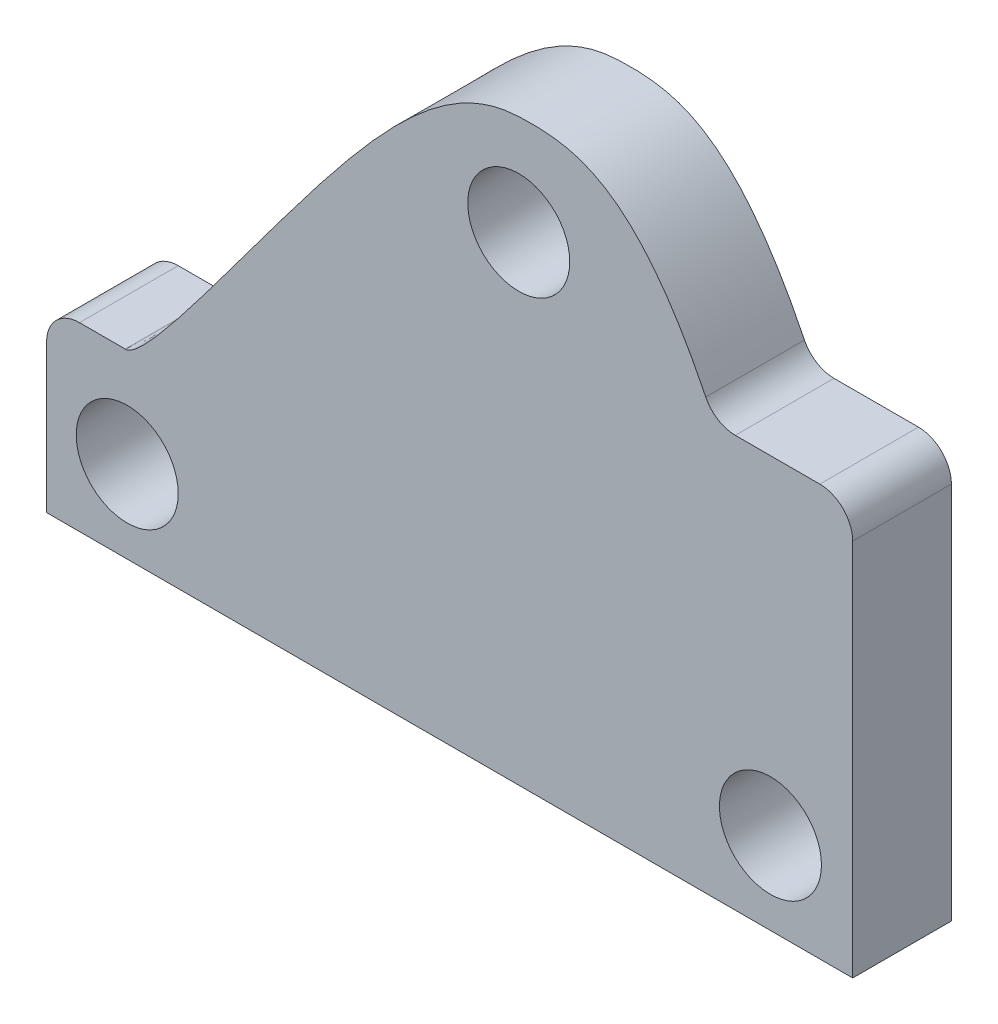
ISO-10303-21;
HEADER;
FILE_DESCRIPTION(('STEP AP214'),'2;1');
FILE_NAME('part.step','',(''),(''),'','','');
FILE_SCHEMA(('AUTOMOTIVE_DESIGN { 1 0 10303 214 1 1 1 1 }'));
ENDSEC;
DATA;
#1=APPLICATION_CONTEXT('core data for automotive mechanical design processes');
#2=APPLICATION_PROTOCOL_DEFINITION('international standard','automotive_design',2000,#1);
#3=PRODUCT_CONTEXT('',#1,'mechanical');
#4=PRODUCT('Part','Part','',(#3));
#5=PRODUCT_RELATED_PRODUCT_CATEGORY('part','',(#4));
#6=PRODUCT_DEFINITION_FORMATION('','',#4);
#7=PRODUCT_DEFINITION_CONTEXT('part definition',#1,'design');
#8=PRODUCT_DEFINITION('design','',#6,#7);
#9=PRODUCT_DEFINITION_SHAPE('','',#8);
#10=(LENGTH_UNIT() NAMED_UNIT(*) SI_UNIT(.MILLI.,.METRE.));
#11=(NAMED_UNIT(*) PLANE_ANGLE_UNIT() SI_UNIT($,.RADIAN.));
#12=(NAMED_UNIT(*) SI_UNIT($,.STERADIAN.) SOLID_ANGLE_UNIT());
#13=UNCERTAINTY_MEASURE_WITH_UNIT(LENGTH_MEASURE(1.E-05),#10,'distance_accuracy_value','');
#14=(GEOMETRIC_REPRESENTATION_CONTEXT(3) GLOBAL_UNCERTAINTY_ASSIGNED_CONTEXT((#13)) GLOBAL_UNIT_ASSIGNED_CONTEXT((#10,
#11,#12)) REPRESENTATION_CONTEXT('',''));
#15=CARTESIAN_POINT('',(0.,0.,0.));
#16=DIRECTION('',(0.,0.,1.));
#17=DIRECTION('',(1.,0.,0.));
#18=AXIS2_PLACEMENT_3D('',#15,#16,#17);
#19=CARTESIAN_POINT('',(-28.575,-10.922,3.81));
#20=DIRECTION('',(0.,0.,1.));
#21=DIRECTION('',(1.,0.,0.));
#22=AXIS2_PLACEMENT_3D('',#19,#20,#21);
#23=PLANE('',#22);
#24=CARTESIAN_POINT('',(-24.892,-16.002,3.81));
#25=DIRECTION('',(0.,0.,1.));
#26=DIRECTION('',(1.,0.,0.));
#27=AXIS2_PLACEMENT_3D('',#24,#25,#26);
#28=CIRCLE('',#27,3.937);
#29=CARTESIAN_POINT('',(-20.955,-16.002,3.81));
#30=VERTEX_POINT('',#29);
#31=EDGE_CURVE('E224',#30,#30,#28,.T.);
#32=ORIENTED_EDGE('',*,*,#31,.F.);
#33=EDGE_LOOP('',(#32));
#34=FACE_BOUND('',#33,.T.);
#35=CARTESIAN_POINT('',(-28.575,-10.922,3.81));
#36=DIRECTION('',(0.,0.,1.));
#37=DIRECTION('',(1.,0.,0.));
#38=AXIS2_PLACEMENT_3D('',#35,#36,#37);
#39=CIRCLE('',#38,2.54);
#40=CARTESIAN_POINT('',(-28.575,-8.38200000000001,3.81));
#41=VERTEX_POINT('',#40);
#42=CARTESIAN_POINT('',(-31.115,-10.922,3.81));
#43=VERTEX_POINT('',#42);
#44=EDGE_CURVE('E173',#41,#43,#39,.T.);
#45=ORIENTED_EDGE('',*,*,#44,.T.);
#46=DIRECTION('',(0.,-1.,0.));
#47=VECTOR('',#46,1.);
#48=CARTESIAN_POINT('',(-31.115,-22.352,3.81));
#49=LINE('',#48,#47);
#50=CARTESIAN_POINT('',(-31.115,-22.352,3.81));
#51=VERTEX_POINT('',#50);
#52=EDGE_CURVE('E103',#43,#51,#49,.T.);
#53=ORIENTED_EDGE('',*,*,#52,.T.);
#54=DIRECTION('',(1.,0.,0.));
#55=VECTOR('',#54,1.);
#56=CARTESIAN_POINT('',(-31.115,-22.352,3.81));
#57=LINE('',#56,#55);
#58=CARTESIAN_POINT('',(31.115,-22.352,3.81));
#59=VERTEX_POINT('',#58);
#60=EDGE_CURVE('E194',#51,#59,#57,.T.);
#61=ORIENTED_EDGE('',*,*,#60,.T.);
#62=DIRECTION('',(0.,1.,0.));
#63=VECTOR('',#62,1.);
#64=CARTESIAN_POINT('',(31.115,6.85799999999998,3.81));
#65=LINE('',#64,#63);
#66=CARTESIAN_POINT('',(31.115,6.85799999999998,3.81));
#67=VERTEX_POINT('',#66);
#68=EDGE_CURVE('E213',#59,#67,#65,.T.);
#69=ORIENTED_EDGE('',*,*,#68,.T.);
#70=CARTESIAN_POINT('',(28.575,6.858,3.81));
#71=DIRECTION('',(0.,0.,1.));
#72=DIRECTION('',(1.,0.,0.));
#73=AXIS2_PLACEMENT_3D('',#70,#71,#72);
#74=CIRCLE('',#73,2.54);
#75=CARTESIAN_POINT('',(28.575,9.398,3.81));
#76=VERTEX_POINT('',#75);
#77=EDGE_CURVE('E210',#67,#76,#74,.T.);
#78=ORIENTED_EDGE('',*,*,#77,.T.);
#79=DIRECTION('',(-1.,0.,0.));
#80=VECTOR('',#79,1.);
#81=CARTESIAN_POINT('',(28.575,9.398,3.81));
#82=LINE('',#81,#80);
#83=CARTESIAN_POINT('',(22.0521966057833,9.398,3.81));
#84=VERTEX_POINT('',#83);
#85=EDGE_CURVE('E212',#76,#84,#82,.T.);
#86=ORIENTED_EDGE('',*,*,#85,.T.);
#87=CARTESIAN_POINT('',(22.0521966057833,11.938,3.81));
#88=DIRECTION('',(0.,0.,-1.));
#89=DIRECTION('',(1.,0.,0.));
#90=AXIS2_PLACEMENT_3D('',#87,#88,#89);
#91=CIRCLE('',#90,2.54);
#92=CARTESIAN_POINT('',(19.7720575329977,10.818819134922,3.81));
#93=VERTEX_POINT('',#92);
#94=EDGE_CURVE('E128',#84,#93,#91,.T.);
#95=ORIENTED_EDGE('',*,*,#94,.T.);
#96=CARTESIAN_POINT('',(19.7720575329977,10.818819134922,3.81));
#97=CARTESIAN_POINT('',(14.6253269787986,21.3043999734678,3.81));
#98=CARTESIAN_POINT('',(9.02206571885566,22.5995282710309,3.81));
#99=CARTESIAN_POINT('',(0.0339421053115481,22.0617132745105,3.81));
#100=CARTESIAN_POINT('',(-6.28366027833182,15.2467378484505,3.81));
#101=CARTESIAN_POINT('',(-18.1029525419765,-0.557115469798815,3.81));
#102=CARTESIAN_POINT('',(-23.8420128021605,-8.40104032261933,3.81));
#103=CARTESIAN_POINT('',(-25.0087831809159,-8.38232663876672,3.81));
#104=B_SPLINE_CURVE_WITH_KNOTS('',3,(#96,#97,#98,#99,#100,#101,#102,#103),.UNSPECIFIED.,.F.,.F.,
(4,1,1,1,1,4),(0.000772689009855242,0.255256993865291,0.324909654256789,0.655922666406158,
0.726463892369997,0.988945287376512),.UNSPECIFIED.);
#105=CARTESIAN_POINT('',(-25.0087831809159,-8.38232663876672,3.81));
#106=VERTEX_POINT('',#105);
#107=EDGE_CURVE('E122',#93,#106,#104,.T.);
#108=ORIENTED_EDGE('',*,*,#107,.T.);
#109=CARTESIAN_POINT('',(-25.0495166836138,-10.922,3.81));
#110=DIRECTION('',(0.,0.,1.));
#111=DIRECTION('',(1.,0.,0.));
#112=AXIS2_PLACEMENT_3D('',#109,#110,#111);
#113=CIRCLE('',#112,2.54);
#114=CARTESIAN_POINT('',(-25.0495166836133,-8.38200000000001,3.81));
#115=VERTEX_POINT('',#114);
#116=EDGE_CURVE('E126',#106,#115,#113,.T.);
#117=ORIENTED_EDGE('',*,*,#116,.T.);
#118=DIRECTION('',(-1.,0.,0.));
#119=VECTOR('',#118,1.);
#120=CARTESIAN_POINT('',(-28.575,-8.38200000000001,3.81));
#121=LINE('',#120,#119);
#122=EDGE_CURVE('E54',#115,#41,#121,.T.);
#123=ORIENTED_EDGE('',*,*,#122,.T.);
#124=EDGE_LOOP('',(#45,#53,#61,#69,#78,#86,#95,#108,#117,#123));
#125=FACE_BOUND('',#124,.T.);
#126=CARTESIAN_POINT('',(5.334,14.605,3.81));
#127=DIRECTION('',(0.,0.,1.));
#128=DIRECTION('',(1.,0.,0.));
#129=AXIS2_PLACEMENT_3D('',#126,#127,#128);
#130=CIRCLE('',#129,3.937);
#131=CARTESIAN_POINT('',(9.27099999999999,14.605,3.81));
#132=VERTEX_POINT('',#131);
#133=EDGE_CURVE('E153',#132,#132,#130,.T.);
#134=ORIENTED_EDGE('',*,*,#133,.F.);
#135=EDGE_LOOP('',(#134));
#136=FACE_BOUND('',#135,.T.);
#137=CARTESIAN_POINT('',(24.765,-16.002,3.81));
#138=DIRECTION('',(0.,0.,1.));
#139=DIRECTION('',(1.,0.,0.));
#140=AXIS2_PLACEMENT_3D('',#137,#138,#139);
#141=CIRCLE('',#140,3.937);
#142=CARTESIAN_POINT('',(28.702,-16.002,3.81));
#143=VERTEX_POINT('',#142);
#144=EDGE_CURVE('E230',#143,#143,#141,.T.);
#145=ORIENTED_EDGE('',*,*,#144,.F.);
#146=EDGE_LOOP('',(#145));
#147=FACE_BOUND('',#146,.T.);
#148=ADVANCED_FACE('F37',(#34,#125,#136,#147),#23,.T.);
#149=CARTESIAN_POINT('',(-28.575,-10.922,-3.81));
#150=DIRECTION('',(0.,0.,1.));
#151=DIRECTION('',(1.,0.,0.));
#152=AXIS2_PLACEMENT_3D('',#149,#150,#151);
#153=PLANE('',#152);
#154=CARTESIAN_POINT('',(-24.892,-16.002,-3.81));
#155=DIRECTION('',(0.,0.,1.));
#156=DIRECTION('',(1.,0.,0.));
#157=AXIS2_PLACEMENT_3D('',#154,#155,#156);
#158=CIRCLE('',#157,3.937);
#159=CARTESIAN_POINT('',(-20.955,-16.002,-3.81));
#160=VERTEX_POINT('',#159);
#161=EDGE_CURVE('E227',#160,#160,#158,.T.);
#162=ORIENTED_EDGE('',*,*,#161,.T.);
#163=EDGE_LOOP('',(#162));
#164=FACE_BOUND('',#163,.T.);
#165=CARTESIAN_POINT('',(-28.575,-10.922,-3.81));
#166=DIRECTION('',(0.,0.,1.));
#167=DIRECTION('',(1.,0.,0.));
#168=AXIS2_PLACEMENT_3D('',#165,#166,#167);
#169=CIRCLE('',#168,2.54);
#170=CARTESIAN_POINT('',(-28.575,-8.38200000000001,-3.81));
#171=VERTEX_POINT('',#170);
#172=CARTESIAN_POINT('',(-31.115,-10.922,-3.81));
#173=VERTEX_POINT('',#172);
#174=EDGE_CURVE('E149',#171,#173,#169,.T.);
#175=ORIENTED_EDGE('',*,*,#174,.F.);
#176=DIRECTION('',(-1.,0.,0.));
#177=VECTOR('',#176,1.);
#178=CARTESIAN_POINT('',(-28.575,-8.38200000000001,-3.81));
#179=LINE('',#178,#177);
#180=CARTESIAN_POINT('',(-25.0495166836133,-8.38200000000001,-3.81));
#181=VERTEX_POINT('',#180);
#182=EDGE_CURVE('E95',#181,#171,#179,.T.);
#183=ORIENTED_EDGE('',*,*,#182,.F.);
#184=CARTESIAN_POINT('',(-25.0495166836138,-10.922,-3.81));
#185=DIRECTION('',(0.,0.,1.));
#186=DIRECTION('',(1.,0.,0.));
#187=AXIS2_PLACEMENT_3D('',#184,#185,#186);
#188=CIRCLE('',#187,2.54);
#189=CARTESIAN_POINT('',(-25.0087831809159,-8.38232663876672,-3.81));
#190=VERTEX_POINT('',#189);
#191=EDGE_CURVE('E89',#190,#181,#188,.T.);
#192=ORIENTED_EDGE('',*,*,#191,.F.);
#193=CARTESIAN_POINT('',(19.7720575329977,10.818819134922,-3.81));
#194=CARTESIAN_POINT('',(14.6253269787986,21.3043999734678,-3.81));
#195=CARTESIAN_POINT('',(9.02206571885566,22.5995282710309,-3.81));
#196=CARTESIAN_POINT('',(0.0339421053115481,22.0617132745105,-3.81));
#197=CARTESIAN_POINT('',(-6.28366027833182,15.2467378484505,-3.81));
#198=CARTESIAN_POINT('',(-18.1029525419765,-0.557115469798815,-3.81));
#199=CARTESIAN_POINT('',(-23.8420128021605,-8.40104032261933,-3.81));
#200=CARTESIAN_POINT('',(-25.0087831809159,-8.38232663876672,-3.81));
#201=B_SPLINE_CURVE_WITH_KNOTS('',3,(#193,#194,#195,#196,#197,#198,#199,#200),.UNSPECIFIED.,.F.,
.F.,(4,1,1,1,1,4),(0.000772689009855242,0.255256993865291,0.324909654256789,0.655922666406158,
0.726463892369997,0.988945287376512),.UNSPECIFIED.);
#202=CARTESIAN_POINT('',(19.7720575329977,10.818819134922,-3.81));
#203=VERTEX_POINT('',#202);
#204=EDGE_CURVE('E136',#203,#190,#201,.T.);
#205=ORIENTED_EDGE('',*,*,#204,.F.);
#206=CARTESIAN_POINT('',(22.0521966057833,11.938,-3.81));
#207=DIRECTION('',(0.,0.,-1.));
#208=DIRECTION('',(1.,0.,0.));
#209=AXIS2_PLACEMENT_3D('',#206,#207,#208);
#210=CIRCLE('',#209,2.54);
#211=CARTESIAN_POINT('',(22.0521966057833,9.398,-3.81));
#212=VERTEX_POINT('',#211);
#213=EDGE_CURVE('E163',#212,#203,#210,.T.);
#214=ORIENTED_EDGE('',*,*,#213,.F.);
#215=DIRECTION('',(-1.,0.,0.));
#216=VECTOR('',#215,1.);
#217=CARTESIAN_POINT('',(28.575,9.398,-3.81));
#218=LINE('',#217,#216);
#219=CARTESIAN_POINT('',(28.575,9.398,-3.81));
#220=VERTEX_POINT('',#219);
#221=EDGE_CURVE('E161',#220,#212,#218,.T.);
#222=ORIENTED_EDGE('',*,*,#221,.F.);
#223=CARTESIAN_POINT('',(28.575,6.858,-3.81));
#224=DIRECTION('',(0.,0.,1.));
#225=DIRECTION('',(1.,0.,0.));
#226=AXIS2_PLACEMENT_3D('',#223,#224,#225);
#227=CIRCLE('',#226,2.54);
#228=CARTESIAN_POINT('',(31.115,6.85799999999998,-3.81));
#229=VERTEX_POINT('',#228);
#230=EDGE_CURVE('E159',#229,#220,#227,.T.);
#231=ORIENTED_EDGE('',*,*,#230,.F.);
#232=DIRECTION('',(0.,1.,0.));
#233=VECTOR('',#232,1.);
#234=CARTESIAN_POINT('',(31.115,6.85799999999998,-3.81));
#235=LINE('',#234,#233);
#236=CARTESIAN_POINT('',(31.115,-22.352,-3.81));
#237=VERTEX_POINT('',#236);
#238=EDGE_CURVE('E157',#237,#229,#235,.T.);
#239=ORIENTED_EDGE('',*,*,#238,.F.);
#240=DIRECTION('',(1.,0.,0.));
#241=VECTOR('',#240,1.);
#242=CARTESIAN_POINT('',(-31.115,-22.352,-3.81));
#243=LINE('',#242,#241);
#244=CARTESIAN_POINT('',(-31.115,-22.352,-3.81));
#245=VERTEX_POINT('',#244);
#246=EDGE_CURVE('E155',#245,#237,#243,.T.);
#247=ORIENTED_EDGE('',*,*,#246,.F.);
#248=DIRECTION('',(0.,-1.,0.));
#249=VECTOR('',#248,1.);
#250=CARTESIAN_POINT('',(-31.115,-22.352,-3.81));
#251=LINE('',#250,#249);
#252=EDGE_CURVE('E152',#173,#245,#251,.T.);
#253=ORIENTED_EDGE('',*,*,#252,.F.);
#254=EDGE_LOOP('',(#175,#183,#192,#205,#214,#222,#231,#239,#247,#253));
#255=FACE_BOUND('',#254,.T.);
#256=CARTESIAN_POINT('',(5.334,14.605,-3.81));
#257=DIRECTION('',(0.,0.,1.));
#258=DIRECTION('',(1.,0.,0.));
#259=AXIS2_PLACEMENT_3D('',#256,#257,#258);
#260=CIRCLE('',#259,3.937);
#261=CARTESIAN_POINT('',(9.27099999999999,14.605,-3.81));
#262=VERTEX_POINT('',#261);
#263=EDGE_CURVE('E221',#262,#262,#260,.T.);
#264=ORIENTED_EDGE('',*,*,#263,.T.);
#265=EDGE_LOOP('',(#264));
#266=FACE_BOUND('',#265,.T.);
#267=CARTESIAN_POINT('',(24.765,-16.002,-3.81));
#268=DIRECTION('',(0.,0.,1.));
#269=DIRECTION('',(1.,0.,0.));
#270=AXIS2_PLACEMENT_3D('',#267,#268,#269);
#271=CIRCLE('',#270,3.937);
#272=CARTESIAN_POINT('',(28.702,-16.002,-3.81));
#273=VERTEX_POINT('',#272);
#274=EDGE_CURVE('E233',#273,#273,#271,.T.);
#275=ORIENTED_EDGE('',*,*,#274,.T.);
#276=EDGE_LOOP('',(#275));
#277=FACE_BOUND('',#276,.T.);
#278=ADVANCED_FACE('F198',(#164,#255,#266,#277),#153,.F.);
#279=CARTESIAN_POINT('',(-28.575,-10.922,3.81));
#280=DIRECTION('',(0.,0.,-1.));
#281=DIRECTION('',(-1.,0.,0.));
#282=AXIS2_PLACEMENT_3D('',#279,#280,#281);
#283=CYLINDRICAL_SURFACE('',#282,2.54);
#284=ORIENTED_EDGE('',*,*,#174,.T.);
#285=DIRECTION('',(0.,0.,-1.));
#286=VECTOR('',#285,1.);
#287=CARTESIAN_POINT('',(-31.115,-10.922,3.81));
#288=LINE('',#287,#286);
#289=EDGE_CURVE('E11',#43,#173,#288,.T.);
#290=ORIENTED_EDGE('',*,*,#289,.F.);
#291=ORIENTED_EDGE('',*,*,#44,.F.);
#292=DIRECTION('',(0.,0.,-1.));
#293=VECTOR('',#292,1.);
#294=CARTESIAN_POINT('',(-28.575,-8.38200000000001,3.81));
#295=LINE('',#294,#293);
#296=EDGE_CURVE('E142',#41,#171,#295,.T.);
#297=ORIENTED_EDGE('',*,*,#296,.T.);
#298=EDGE_LOOP('',(#284,#290,#291,#297));
#299=FACE_BOUND('',#298,.T.);
#300=ADVANCED_FACE('F39',(#299),#283,.T.);
#301=CARTESIAN_POINT('',(-31.115,-22.352,3.81));
#302=DIRECTION('',(1.,0.,0.));
#303=DIRECTION('',(0.,0.,-1.));
#304=AXIS2_PLACEMENT_3D('',#301,#302,#303);
#305=PLANE('',#304);
#306=ORIENTED_EDGE('',*,*,#252,.T.);
#307=DIRECTION('',(0.,0.,-1.));
#308=VECTOR('',#307,1.);
#309=CARTESIAN_POINT('',(-31.115,-22.352,3.81));
#310=LINE('',#309,#308);
#311=EDGE_CURVE('E46',#51,#245,#310,.T.);
#312=ORIENTED_EDGE('',*,*,#311,.F.);
#313=ORIENTED_EDGE('',*,*,#52,.F.);
#314=ORIENTED_EDGE('',*,*,#289,.T.);
#315=EDGE_LOOP('',(#306,#312,#313,#314));
#316=FACE_BOUND('',#315,.T.);
#317=ADVANCED_FACE('F275',(#316),#305,.F.);
#318=CARTESIAN_POINT('',(-31.115,-22.352,3.81));
#319=DIRECTION('',(0.,1.,0.));
#320=DIRECTION('',(0.,0.,1.));
#321=AXIS2_PLACEMENT_3D('',#318,#319,#320);
#322=PLANE('',#321);
#323=ORIENTED_EDGE('',*,*,#246,.T.);
#324=DIRECTION('',(0.,0.,-1.));
#325=VECTOR('',#324,1.);
#326=CARTESIAN_POINT('',(31.115,-22.352,3.81));
#327=LINE('',#326,#325);
#328=EDGE_CURVE('E186',#59,#237,#327,.T.);
#329=ORIENTED_EDGE('',*,*,#328,.F.);
#330=ORIENTED_EDGE('',*,*,#60,.F.);
#331=ORIENTED_EDGE('',*,*,#311,.T.);
#332=EDGE_LOOP('',(#323,#329,#330,#331));
#333=FACE_BOUND('',#332,.T.);
#334=ADVANCED_FACE('F192',(#333),#322,.F.);
#335=CARTESIAN_POINT('',(31.115,6.85799999999998,3.81));
#336=DIRECTION('',(-1.,0.,0.));
#337=DIRECTION('',(0.,0.,1.));
#338=AXIS2_PLACEMENT_3D('',#335,#336,#337);
#339=PLANE('',#338);
#340=ORIENTED_EDGE('',*,*,#238,.T.);
#341=DIRECTION('',(0.,0.,-1.));
#342=VECTOR('',#341,1.);
#343=CARTESIAN_POINT('',(31.115,6.85799999999998,3.81));
#344=LINE('',#343,#342);
#345=EDGE_CURVE('E183',#67,#229,#344,.T.);
#346=ORIENTED_EDGE('',*,*,#345,.F.);
#347=ORIENTED_EDGE('',*,*,#68,.F.);
#348=ORIENTED_EDGE('',*,*,#328,.T.);
#349=EDGE_LOOP('',(#340,#346,#347,#348));
#350=FACE_BOUND('',#349,.T.);
#351=ADVANCED_FACE('F204',(#350),#339,.F.);
#352=CARTESIAN_POINT('',(28.575,6.858,3.81));
#353=DIRECTION('',(0.,0.,-1.));
#354=DIRECTION('',(-1.,0.,0.));
#355=AXIS2_PLACEMENT_3D('',#352,#353,#354);
#356=CYLINDRICAL_SURFACE('',#355,2.54);
#357=ORIENTED_EDGE('',*,*,#230,.T.);
#358=DIRECTION('',(0.,0.,-1.));
#359=VECTOR('',#358,1.);
#360=CARTESIAN_POINT('',(28.575,9.398,3.81));
#361=LINE('',#360,#359);
#362=EDGE_CURVE('E180',#76,#220,#361,.T.);
#363=ORIENTED_EDGE('',*,*,#362,.F.);
#364=ORIENTED_EDGE('',*,*,#77,.F.);
#365=ORIENTED_EDGE('',*,*,#345,.T.);
#366=EDGE_LOOP('',(#357,#363,#364,#365));
#367=FACE_BOUND('',#366,.T.);
#368=ADVANCED_FACE('F208',(#367),#356,.T.);
#369=CARTESIAN_POINT('',(28.575,9.398,3.81));
#370=DIRECTION('',(0.,-1.,0.));
#371=DIRECTION('',(1.,0.,0.));
#372=AXIS2_PLACEMENT_3D('',#369,#370,#371);
#373=PLANE('',#372);
#374=ORIENTED_EDGE('',*,*,#221,.T.);
#375=DIRECTION('',(0.,0.,-1.));
#376=VECTOR('',#375,1.);
#377=CARTESIAN_POINT('',(22.0521966057833,9.398,3.81));
#378=LINE('',#377,#376);
#379=EDGE_CURVE('E177',#84,#212,#378,.T.);
#380=ORIENTED_EDGE('',*,*,#379,.F.);
#381=ORIENTED_EDGE('',*,*,#85,.F.);
#382=ORIENTED_EDGE('',*,*,#362,.T.);
#383=EDGE_LOOP('',(#374,#380,#381,#382));
#384=FACE_BOUND('',#383,.T.);
#385=ADVANCED_FACE('F265',(#384),#373,.F.);
#386=CARTESIAN_POINT('',(22.0521966057833,11.938,3.81));
#387=DIRECTION('',(0.,0.,-1.));
#388=DIRECTION('',(-1.,0.,0.));
#389=AXIS2_PLACEMENT_3D('',#386,#387,#388);
#390=CYLINDRICAL_SURFACE('',#389,2.54);
#391=ORIENTED_EDGE('',*,*,#213,.T.);
#392=DIRECTION('',(0.,0.,-1.));
#393=VECTOR('',#392,1.);
#394=CARTESIAN_POINT('',(19.7720575329977,10.818819134922,3.81));
#395=LINE('',#394,#393);
#396=EDGE_CURVE('E137',#93,#203,#395,.T.);
#397=ORIENTED_EDGE('',*,*,#396,.F.);
#398=ORIENTED_EDGE('',*,*,#94,.F.);
#399=ORIENTED_EDGE('',*,*,#379,.T.);
#400=EDGE_LOOP('',(#391,#397,#398,#399));
#401=FACE_BOUND('',#400,.T.);
#402=ADVANCED_FACE('F262',(#401),#390,.F.);
#403=DIRECTION('',(0.,0.,-1.));
#404=VECTOR('',#403,1.);
#405=SURFACE_OF_LINEAR_EXTRUSION('',#104,#404);
#406=ORIENTED_EDGE('',*,*,#204,.T.);
#407=DIRECTION('',(0.,0.,-1.));
#408=VECTOR('',#407,1.);
#409=CARTESIAN_POINT('',(-25.0087831809159,-8.38232663876672,3.81));
#410=LINE('',#409,#408);
#411=EDGE_CURVE('E133',#106,#190,#410,.T.);
#412=ORIENTED_EDGE('',*,*,#411,.F.);
#413=ORIENTED_EDGE('',*,*,#107,.F.);
#414=ORIENTED_EDGE('',*,*,#396,.T.);
#415=EDGE_LOOP('',(#406,#412,#413,#414));
#416=FACE_BOUND('',#415,.T.);
#417=ADVANCED_FACE('F134',(#416),#405,.F.);
#418=CARTESIAN_POINT('',(-25.0495166836138,-10.922,3.81));
#419=DIRECTION('',(0.,0.,-1.));
#420=DIRECTION('',(-1.,0.,0.));
#421=AXIS2_PLACEMENT_3D('',#418,#419,#420);
#422=CYLINDRICAL_SURFACE('',#421,2.54);
#423=ORIENTED_EDGE('',*,*,#191,.T.);
#424=DIRECTION('',(0.,0.,-1.));
#425=VECTOR('',#424,1.);
#426=CARTESIAN_POINT('',(-25.0495166836133,-8.38200000000001,3.81));
#427=LINE('',#426,#425);
#428=EDGE_CURVE('E138',#115,#181,#427,.T.);
#429=ORIENTED_EDGE('',*,*,#428,.F.);
#430=ORIENTED_EDGE('',*,*,#116,.F.);
#431=ORIENTED_EDGE('',*,*,#411,.T.);
#432=EDGE_LOOP('',(#423,#429,#430,#431));
#433=FACE_BOUND('',#432,.T.);
#434=ADVANCED_FACE('F140',(#433),#422,.T.);
#435=CARTESIAN_POINT('',(-28.575,-8.38200000000001,3.81));
#436=DIRECTION('',(0.,-1.,0.));
#437=DIRECTION('',(1.,0.,0.));
#438=AXIS2_PLACEMENT_3D('',#435,#436,#437);
#439=PLANE('',#438);
#440=ORIENTED_EDGE('',*,*,#182,.T.);
#441=ORIENTED_EDGE('',*,*,#296,.F.);
#442=ORIENTED_EDGE('',*,*,#122,.F.);
#443=ORIENTED_EDGE('',*,*,#428,.T.);
#444=EDGE_LOOP('',(#440,#441,#442,#443));
#445=FACE_BOUND('',#444,.T.);
#446=ADVANCED_FACE('F255',(#445),#439,.F.);
#447=CARTESIAN_POINT('',(5.334,14.605,3.81));
#448=DIRECTION('',(0.,0.,-1.));
#449=DIRECTION('',(-1.,0.,0.));
#450=AXIS2_PLACEMENT_3D('',#447,#448,#449);
#451=CYLINDRICAL_SURFACE('',#450,3.937);
#452=ORIENTED_EDGE('',*,*,#133,.T.);
#453=EDGE_LOOP('',(#452));
#454=FACE_BOUND('',#453,.T.);
#455=ORIENTED_EDGE('',*,*,#263,.F.);
#456=EDGE_LOOP('',(#455));
#457=FACE_BOUND('',#456,.T.);
#458=ADVANCED_FACE('F252',(#454,#457),#451,.F.);
#459=CARTESIAN_POINT('',(-24.892,-16.002,3.81));
#460=DIRECTION('',(0.,0.,-1.));
#461=DIRECTION('',(-1.,0.,0.));
#462=AXIS2_PLACEMENT_3D('',#459,#460,#461);
#463=CYLINDRICAL_SURFACE('',#462,3.937);
#464=ORIENTED_EDGE('',*,*,#31,.T.);
#465=EDGE_LOOP('',(#464));
#466=FACE_BOUND('',#465,.T.);
#467=ORIENTED_EDGE('',*,*,#161,.F.);
#468=EDGE_LOOP('',(#467));
#469=FACE_BOUND('',#468,.T.);
#470=ADVANCED_FACE('F351',(#466,#469),#463,.F.);
#471=CARTESIAN_POINT('',(24.765,-16.002,3.81));
#472=DIRECTION('',(0.,0.,-1.));
#473=DIRECTION('',(-1.,0.,0.));
#474=AXIS2_PLACEMENT_3D('',#471,#472,#473);
#475=CYLINDRICAL_SURFACE('',#474,3.937);
#476=ORIENTED_EDGE('',*,*,#144,.T.);
#477=EDGE_LOOP('',(#476));
#478=FACE_BOUND('',#477,.T.);
#479=ORIENTED_EDGE('',*,*,#274,.F.);
#480=EDGE_LOOP('',(#479));
#481=FACE_BOUND('',#480,.T.);
#482=ADVANCED_FACE('F239',(#478,#481),#475,.F.);
#483=CLOSED_SHELL('',(#148,#278,#300,#317,#334,#351,#368,#385,#402,#417,#434,#446,#458,#470,#482));
#484=MANIFOLD_SOLID_BREP('B2',#483);
#485=ADVANCED_BREP_SHAPE_REPRESENTATION('',(#18,#484),#14);
#486=SHAPE_DEFINITION_REPRESENTATION(#9,#485);
ENDSEC;
END-ISO-10303-21;
